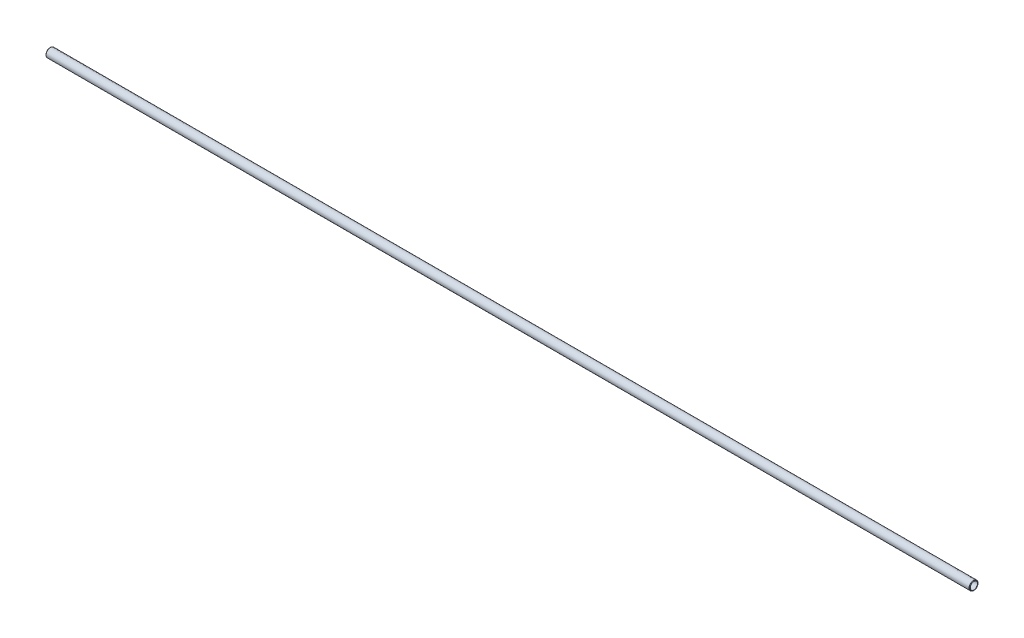
ISO-10303-21;
HEADER;
FILE_DESCRIPTION(('STEP AP214'),'2;1');
FILE_NAME('part.step','',(''),(''),'','','');
FILE_SCHEMA(('AUTOMOTIVE_DESIGN { 1 0 10303 214 1 1 1 1 }'));
ENDSEC;
DATA;
#1=APPLICATION_CONTEXT('core data for automotive mechanical design processes');
#2=APPLICATION_PROTOCOL_DEFINITION('international standard','automotive_design',2000,#1);
#3=PRODUCT_CONTEXT('',#1,'mechanical');
#4=PRODUCT('Part','Part','',(#3));
#5=PRODUCT_RELATED_PRODUCT_CATEGORY('part','',(#4));
#6=PRODUCT_DEFINITION_FORMATION('','',#4);
#7=PRODUCT_DEFINITION_CONTEXT('part definition',#1,'design');
#8=PRODUCT_DEFINITION('design','',#6,#7);
#9=PRODUCT_DEFINITION_SHAPE('','',#8);
#10=(LENGTH_UNIT() NAMED_UNIT(*) SI_UNIT(.MILLI.,.METRE.));
#11=(NAMED_UNIT(*) PLANE_ANGLE_UNIT() SI_UNIT($,.RADIAN.));
#12=(NAMED_UNIT(*) SI_UNIT($,.STERADIAN.) SOLID_ANGLE_UNIT());
#13=UNCERTAINTY_MEASURE_WITH_UNIT(LENGTH_MEASURE(1.E-05),#10,'distance_accuracy_value','');
#14=(GEOMETRIC_REPRESENTATION_CONTEXT(3) GLOBAL_UNCERTAINTY_ASSIGNED_CONTEXT((#13)) GLOBAL_UNIT_ASSIGNED_CONTEXT((#10,
#11,#12)) REPRESENTATION_CONTEXT('',''));
#15=CARTESIAN_POINT('',(0.,0.,0.));
#16=DIRECTION('',(0.,0.,1.));
#17=DIRECTION('',(1.,0.,0.));
#18=AXIS2_PLACEMENT_3D('',#15,#16,#17);
#19=CARTESIAN_POINT('',(-0.306605122421363,0.,0.));
#20=DIRECTION('',(-1.,0.,0.));
#21=DIRECTION('',(0.,0.,1.));
#22=AXIS2_PLACEMENT_3D('',#19,#20,#21);
#23=TOROIDAL_SURFACE('',#22,5.3947602448428,0.127000000000017);
#24=CARTESIAN_POINT('',(-0.396407683632027,0.,0.));
#25=DIRECTION('',(-1.,0.,0.));
#26=DIRECTION('',(0.,0.,1.));
#27=AXIS2_PLACEMENT_3D('',#24,#25,#26);
#28=CIRCLE('',#27,5.3049576836321);
#29=CARTESIAN_POINT('',(-0.396407683632027,0.,5.3049576836321));
#30=VERTEX_POINT('',#29);
#31=EDGE_CURVE('E10',#30,#30,#28,.T.);
#32=ORIENTED_EDGE('',*,*,#31,.F.);
#33=EDGE_LOOP('',(#32));
#34=FACE_BOUND('',#33,.T.);
#35=CARTESIAN_POINT('',(-0.396407683632027,0.,0.));
#36=DIRECTION('',(-1.,0.,0.));
#37=DIRECTION('',(0.,0.,1.));
#38=AXIS2_PLACEMENT_3D('',#35,#36,#37);
#39=CIRCLE('',#38,5.4845628060535);
#40=CARTESIAN_POINT('',(-0.396407683632027,0.,5.4845628060535));
#41=VERTEX_POINT('',#40);
#42=EDGE_CURVE('E78',#41,#41,#39,.T.);
#43=ORIENTED_EDGE('',*,*,#42,.T.);
#44=EDGE_LOOP('',(#43));
#45=FACE_BOUND('',#44,.T.);
#46=ADVANCED_FACE('F32',(#34,#45),#23,.T.);
#47=CARTESIAN_POINT('',(-0.396407683632027,0.,0.));
#48=DIRECTION('',(-1.,0.,0.));
#49=DIRECTION('',(0.,0.,1.));
#50=AXIS2_PLACEMENT_3D('',#47,#48,#49);
#51=CONICAL_SURFACE('',#50,5.3049576836321,0.785398163397622);
#52=CARTESIAN_POINT('',(-0.253999999999976,0.,0.));
#53=DIRECTION('',(-1.,0.,0.));
#54=DIRECTION('',(0.,0.,1.));
#55=AXIS2_PLACEMENT_3D('',#52,#53,#54);
#56=CIRCLE('',#55,5.16255);
#57=CARTESIAN_POINT('',(-0.253999999999976,0.,5.16255));
#58=VERTEX_POINT('',#57);
#59=EDGE_CURVE('E38',#58,#58,#56,.T.);
#60=ORIENTED_EDGE('',*,*,#59,.F.);
#61=EDGE_LOOP('',(#60));
#62=FACE_BOUND('',#61,.T.);
#63=ORIENTED_EDGE('',*,*,#31,.T.);
#64=EDGE_LOOP('',(#63));
#65=FACE_BOUND('',#64,.T.);
#66=ADVANCED_FACE('F151',(#62,#65),#51,.F.);
#67=CARTESIAN_POINT('',(1289.558,0.,0.));
#68=DIRECTION('',(-1.,0.,0.));
#69=DIRECTION('',(0.,0.,1.));
#70=AXIS2_PLACEMENT_3D('',#67,#68,#69);
#71=CYLINDRICAL_SURFACE('',#70,5.16255);
#72=CARTESIAN_POINT('',(0.,0.,0.));
#73=DIRECTION('',(-1.,0.,0.));
#74=DIRECTION('',(0.,0.,1.));
#75=AXIS2_PLACEMENT_3D('',#72,#73,#74);
#76=CIRCLE('',#75,5.16255);
#77=CARTESIAN_POINT('',(0.,0.,5.16255));
#78=VERTEX_POINT('',#77);
#79=EDGE_CURVE('E42',#78,#78,#76,.T.);
#80=ORIENTED_EDGE('',*,*,#79,.F.);
#81=EDGE_LOOP('',(#80));
#82=FACE_BOUND('',#81,.T.);
#83=ORIENTED_EDGE('',*,*,#59,.T.);
#84=EDGE_LOOP('',(#83));
#85=FACE_BOUND('',#84,.T.);
#86=ADVANCED_FACE('F146',(#82,#85),#71,.F.);
#87=CARTESIAN_POINT('',(0.,0.,0.));
#88=DIRECTION('',(1.,0.,0.));
#89=DIRECTION('',(0.,0.,-1.));
#90=AXIS2_PLACEMENT_3D('',#87,#88,#89);
#91=CONICAL_SURFACE('',#90,5.16255,0.785398163397495);
#92=CARTESIAN_POINT('',(0.507999999999953,0.,0.));
#93=DIRECTION('',(-1.,0.,0.));
#94=DIRECTION('',(0.,0.,1.));
#95=AXIS2_PLACEMENT_3D('',#92,#93,#94);
#96=CIRCLE('',#95,5.67055);
#97=CARTESIAN_POINT('',(0.507999999999953,0.,5.67055));
#98=VERTEX_POINT('',#97);
#99=EDGE_CURVE('E46',#98,#98,#96,.T.);
#100=ORIENTED_EDGE('',*,*,#99,.F.);
#101=EDGE_LOOP('',(#100));
#102=FACE_BOUND('',#101,.T.);
#103=ORIENTED_EDGE('',*,*,#79,.T.);
#104=EDGE_LOOP('',(#103));
#105=FACE_BOUND('',#104,.T.);
#106=ADVANCED_FACE('F140',(#102,#105),#91,.F.);
#107=CARTESIAN_POINT('',(1289.558,0.,0.));
#108=DIRECTION('',(-1.,0.,0.));
#109=DIRECTION('',(0.,0.,1.));
#110=AXIS2_PLACEMENT_3D('',#107,#108,#109);
#111=CYLINDRICAL_SURFACE('',#110,5.67055);
#112=CARTESIAN_POINT('',(1289.05,0.,0.));
#113=DIRECTION('',(-1.,0.,0.));
#114=DIRECTION('',(0.,0.,1.));
#115=AXIS2_PLACEMENT_3D('',#112,#113,#114);
#116=CIRCLE('',#115,5.67055);
#117=CARTESIAN_POINT('',(1289.05,0.,5.67055));
#118=VERTEX_POINT('',#117);
#119=EDGE_CURVE('E51',#118,#118,#116,.T.);
#120=ORIENTED_EDGE('',*,*,#119,.F.);
#121=EDGE_LOOP('',(#120));
#122=FACE_BOUND('',#121,.T.);
#123=ORIENTED_EDGE('',*,*,#99,.T.);
#124=EDGE_LOOP('',(#123));
#125=FACE_BOUND('',#124,.T.);
#126=ADVANCED_FACE('F134',(#122,#125),#111,.F.);
#127=CARTESIAN_POINT('',(1289.05,0.,0.));
#128=DIRECTION('',(-1.,0.,0.));
#129=DIRECTION('',(0.,0.,1.));
#130=AXIS2_PLACEMENT_3D('',#127,#128,#129);
#131=CONICAL_SURFACE('',#130,5.67055,0.785398163397495);
#132=CARTESIAN_POINT('',(1289.558,0.,0.));
#133=DIRECTION('',(-1.,0.,0.));
#134=DIRECTION('',(0.,0.,1.));
#135=AXIS2_PLACEMENT_3D('',#132,#133,#134);
#136=CIRCLE('',#135,5.16255);
#137=CARTESIAN_POINT('',(1289.558,0.,5.16255));
#138=VERTEX_POINT('',#137);
#139=EDGE_CURVE('E54',#138,#138,#136,.T.);
#140=ORIENTED_EDGE('',*,*,#139,.F.);
#141=EDGE_LOOP('',(#140));
#142=FACE_BOUND('',#141,.T.);
#143=ORIENTED_EDGE('',*,*,#119,.T.);
#144=EDGE_LOOP('',(#143));
#145=FACE_BOUND('',#144,.T.);
#146=ADVANCED_FACE('F128',(#142,#145),#131,.F.);
#147=CARTESIAN_POINT('',(1289.558,0.,0.));
#148=DIRECTION('',(-1.,0.,0.));
#149=DIRECTION('',(0.,0.,1.));
#150=AXIS2_PLACEMENT_3D('',#147,#148,#149);
#151=CYLINDRICAL_SURFACE('',#150,5.16255);
#152=CARTESIAN_POINT('',(1289.812,0.,0.));
#153=DIRECTION('',(-1.,0.,0.));
#154=DIRECTION('',(0.,0.,1.));
#155=AXIS2_PLACEMENT_3D('',#152,#153,#154);
#156=CIRCLE('',#155,5.16255);
#157=CARTESIAN_POINT('',(1289.812,0.,5.16255));
#158=VERTEX_POINT('',#157);
#159=EDGE_CURVE('E57',#158,#158,#156,.T.);
#160=ORIENTED_EDGE('',*,*,#159,.F.);
#161=EDGE_LOOP('',(#160));
#162=FACE_BOUND('',#161,.T.);
#163=ORIENTED_EDGE('',*,*,#139,.T.);
#164=EDGE_LOOP('',(#163));
#165=FACE_BOUND('',#164,.T.);
#166=ADVANCED_FACE('F122',(#162,#165),#151,.F.);
#167=CARTESIAN_POINT('',(1289.812,0.,0.));
#168=DIRECTION('',(1.,0.,0.));
#169=DIRECTION('',(0.,0.,-1.));
#170=AXIS2_PLACEMENT_3D('',#167,#168,#169);
#171=CONICAL_SURFACE('',#170,5.16255,0.785398163397229);
#172=CARTESIAN_POINT('',(1289.95440768363,0.,0.));
#173=DIRECTION('',(-1.,0.,0.));
#174=DIRECTION('',(0.,0.,1.));
#175=AXIS2_PLACEMENT_3D('',#172,#173,#174);
#176=CIRCLE('',#175,5.30495768362666);
#177=CARTESIAN_POINT('',(1289.95440768363,0.,5.30495768362666));
#178=VERTEX_POINT('',#177);
#179=EDGE_CURVE('E60',#178,#178,#176,.T.);
#180=ORIENTED_EDGE('',*,*,#179,.F.);
#181=EDGE_LOOP('',(#180));
#182=FACE_BOUND('',#181,.T.);
#183=ORIENTED_EDGE('',*,*,#159,.T.);
#184=EDGE_LOOP('',(#183));
#185=FACE_BOUND('',#184,.T.);
#186=ADVANCED_FACE('F116',(#182,#185),#171,.F.);
#187=CARTESIAN_POINT('',(1289.86460512244,0.,0.));
#188=DIRECTION('',(-1.,0.,0.));
#189=DIRECTION('',(0.,0.,1.));
#190=AXIS2_PLACEMENT_3D('',#187,#188,#189);
#191=TOROIDAL_SURFACE('',#190,5.39476024482149,0.126999999974119);
#192=CARTESIAN_POINT('',(1289.95440768363,0.,0.));
#193=DIRECTION('',(-1.,0.,0.));
#194=DIRECTION('',(0.,0.,1.));
#195=AXIS2_PLACEMENT_3D('',#192,#193,#194);
#196=CIRCLE('',#195,5.48456280601653);
#197=CARTESIAN_POINT('',(1289.95440768363,0.,5.48456280601653));
#198=VERTEX_POINT('',#197);
#199=EDGE_CURVE('E63',#198,#198,#196,.T.);
#200=ORIENTED_EDGE('',*,*,#199,.F.);
#201=EDGE_LOOP('',(#200));
#202=FACE_BOUND('',#201,.T.);
#203=ORIENTED_EDGE('',*,*,#179,.T.);
#204=EDGE_LOOP('',(#203));
#205=FACE_BOUND('',#204,.T.);
#206=ADVANCED_FACE('F110',(#202,#205),#191,.T.);
#207=CARTESIAN_POINT('',(1289.95440768363,0.,0.));
#208=DIRECTION('',(-1.,0.,0.));
#209=DIRECTION('',(0.,0.,1.));
#210=AXIS2_PLACEMENT_3D('',#207,#208,#209);
#211=CONICAL_SURFACE('',#210,5.48456280601653,0.785398163397511);
#212=CARTESIAN_POINT('',(1289.4219102448,0.,0.));
#213=DIRECTION('',(-1.,0.,0.));
#214=DIRECTION('',(0.,0.,1.));
#215=AXIS2_PLACEMENT_3D('',#212,#213,#214);
#216=CIRCLE('',#215,6.01706024484292);
#217=CARTESIAN_POINT('',(1289.4219102448,0.,6.01706024484292));
#218=VERTEX_POINT('',#217);
#219=EDGE_CURVE('E66',#218,#218,#216,.T.);
#220=ORIENTED_EDGE('',*,*,#219,.F.);
#221=EDGE_LOOP('',(#220));
#222=FACE_BOUND('',#221,.T.);
#223=ORIENTED_EDGE('',*,*,#199,.T.);
#224=EDGE_LOOP('',(#223));
#225=FACE_BOUND('',#224,.T.);
#226=ADVANCED_FACE('F104',(#222,#225),#211,.T.);
#227=CARTESIAN_POINT('',(1289.06269999996,0.,0.));
#228=DIRECTION('',(-1.,0.,0.));
#229=DIRECTION('',(0.,0.,1.));
#230=AXIS2_PLACEMENT_3D('',#227,#228,#229);
#231=TOROIDAL_SURFACE('',#230,5.65785000000531,0.507999999994734);
#232=CARTESIAN_POINT('',(1289.06269999996,0.,0.));
#233=DIRECTION('',(-1.,0.,0.));
#234=DIRECTION('',(0.,0.,1.));
#235=AXIS2_PLACEMENT_3D('',#232,#233,#234);
#236=CIRCLE('',#235,6.16585000000016);
#237=CARTESIAN_POINT('',(1289.06269999996,0.,6.16585000000016));
#238=VERTEX_POINT('',#237);
#239=EDGE_CURVE('E69',#238,#238,#236,.T.);
#240=ORIENTED_EDGE('',*,*,#239,.F.);
#241=EDGE_LOOP('',(#240));
#242=FACE_BOUND('',#241,.T.);
#243=ORIENTED_EDGE('',*,*,#219,.T.);
#244=EDGE_LOOP('',(#243));
#245=FACE_BOUND('',#244,.T.);
#246=ADVANCED_FACE('F98',(#242,#245),#231,.T.);
#247=CARTESIAN_POINT('',(1289.558,0.,0.));
#248=DIRECTION('',(-1.,0.,0.));
#249=DIRECTION('',(0.,0.,1.));
#250=AXIS2_PLACEMENT_3D('',#247,#248,#249);
#251=CYLINDRICAL_SURFACE('',#250,6.16585000000008);
#252=CARTESIAN_POINT('',(0.495300000000087,0.,0.));
#253=DIRECTION('',(-1.,0.,0.));
#254=DIRECTION('',(0.,0.,1.));
#255=AXIS2_PLACEMENT_3D('',#252,#253,#254);
#256=CIRCLE('',#255,6.16585);
#257=CARTESIAN_POINT('',(0.495300000000087,0.,6.16585));
#258=VERTEX_POINT('',#257);
#259=EDGE_CURVE('E72',#258,#258,#256,.T.);
#260=ORIENTED_EDGE('',*,*,#259,.F.);
#261=EDGE_LOOP('',(#260));
#262=FACE_BOUND('',#261,.T.);
#263=ORIENTED_EDGE('',*,*,#239,.T.);
#264=EDGE_LOOP('',(#263));
#265=FACE_BOUND('',#264,.T.);
#266=ADVANCED_FACE('F92',(#262,#265),#251,.T.);
#267=CARTESIAN_POINT('',(0.495300000000047,0.,0.));
#268=DIRECTION('',(-1.,0.,0.));
#269=DIRECTION('',(0.,0.,1.));
#270=AXIS2_PLACEMENT_3D('',#267,#268,#269);
#271=TOROIDAL_SURFACE('',#270,5.65784999999979,0.508000000000205);
#272=CARTESIAN_POINT('',(0.13608975515722,0.,0.));
#273=DIRECTION('',(-1.,0.,0.));
#274=DIRECTION('',(0.,0.,1.));
#275=AXIS2_PLACEMENT_3D('',#272,#273,#274);
#276=CIRCLE('',#275,6.0170602448428);
#277=CARTESIAN_POINT('',(0.13608975515722,0.,6.0170602448428));
#278=VERTEX_POINT('',#277);
#279=EDGE_CURVE('E75',#278,#278,#276,.T.);
#280=ORIENTED_EDGE('',*,*,#279,.F.);
#281=EDGE_LOOP('',(#280));
#282=FACE_BOUND('',#281,.T.);
#283=ORIENTED_EDGE('',*,*,#259,.T.);
#284=EDGE_LOOP('',(#283));
#285=FACE_BOUND('',#284,.T.);
#286=ADVANCED_FACE('F86',(#282,#285),#271,.T.);
#287=CARTESIAN_POINT('',(0.13608975515722,0.,0.));
#288=DIRECTION('',(1.,0.,0.));
#289=DIRECTION('',(0.,0.,-1.));
#290=AXIS2_PLACEMENT_3D('',#287,#288,#289);
#291=CONICAL_SURFACE('',#290,6.0170602448428,0.785398163397497);
#292=ORIENTED_EDGE('',*,*,#42,.F.);
#293=EDGE_LOOP('',(#292));
#294=FACE_BOUND('',#293,.T.);
#295=ORIENTED_EDGE('',*,*,#279,.T.);
#296=EDGE_LOOP('',(#295));
#297=FACE_BOUND('',#296,.T.);
#298=ADVANCED_FACE('F83',(#294,#297),#291,.T.);
#299=CLOSED_SHELL('',(#46,#66,#86,#106,#126,#146,#166,#186,#206,#226,#246,#266,#286,#298));
#300=MANIFOLD_SOLID_BREP('B2',#299);
#301=ADVANCED_BREP_SHAPE_REPRESENTATION('',(#18,#300),#14);
#302=SHAPE_DEFINITION_REPRESENTATION(#9,#301);
ENDSEC;
END-ISO-10303-21;
